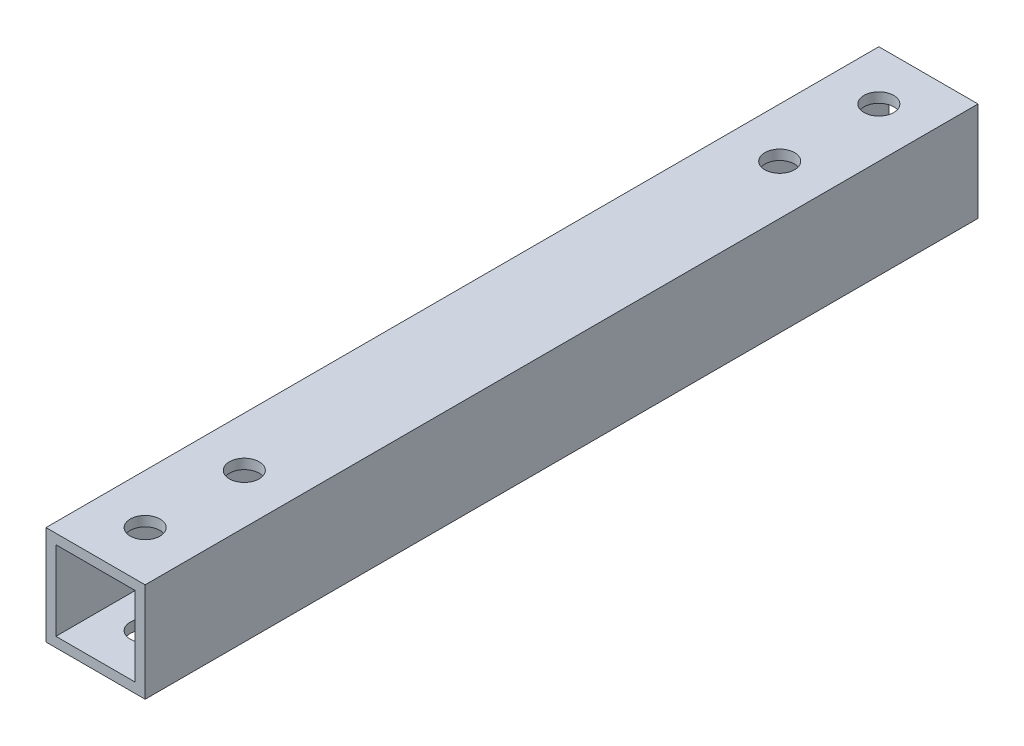
ISO-10303-21;
HEADER;
FILE_DESCRIPTION(('STEP AP214'),'2;1');
FILE_NAME('part.step','',(''),(''),'','','');
FILE_SCHEMA(('AUTOMOTIVE_DESIGN { 1 0 10303 214 1 1 1 1 }'));
ENDSEC;
DATA;
#1=APPLICATION_CONTEXT('core data for automotive mechanical design processes');
#2=APPLICATION_PROTOCOL_DEFINITION('international standard','automotive_design',2000,#1);
#3=PRODUCT_CONTEXT('',#1,'mechanical');
#4=PRODUCT('Part','Part','',(#3));
#5=PRODUCT_RELATED_PRODUCT_CATEGORY('part','',(#4));
#6=PRODUCT_DEFINITION_FORMATION('','',#4);
#7=PRODUCT_DEFINITION_CONTEXT('part definition',#1,'design');
#8=PRODUCT_DEFINITION('design','',#6,#7);
#9=PRODUCT_DEFINITION_SHAPE('','',#8);
#10=(LENGTH_UNIT() NAMED_UNIT(*) SI_UNIT(.MILLI.,.METRE.));
#11=(NAMED_UNIT(*) PLANE_ANGLE_UNIT() SI_UNIT($,.RADIAN.));
#12=(NAMED_UNIT(*) SI_UNIT($,.STERADIAN.) SOLID_ANGLE_UNIT());
#13=UNCERTAINTY_MEASURE_WITH_UNIT(LENGTH_MEASURE(1.E-05),#10,'distance_accuracy_value','');
#14=(GEOMETRIC_REPRESENTATION_CONTEXT(3) GLOBAL_UNCERTAINTY_ASSIGNED_CONTEXT((#13)) GLOBAL_UNIT_ASSIGNED_CONTEXT((#10,
#11,#12)) REPRESENTATION_CONTEXT('',''));
#15=CARTESIAN_POINT('',(0.,0.,0.));
#16=DIRECTION('',(0.,0.,1.));
#17=DIRECTION('',(1.,0.,0.));
#18=AXIS2_PLACEMENT_3D('',#15,#16,#17);
#19=CARTESIAN_POINT('',(0.,0.,84.));
#20=DIRECTION('',(0.,0.,1.));
#21=DIRECTION('',(1.,0.,0.));
#22=AXIS2_PLACEMENT_3D('',#19,#20,#21);
#23=PLANE('',#22);
#24=DIRECTION('',(0.,-1.,0.));
#25=VECTOR('',#24,1.);
#26=CARTESIAN_POINT('',(-77.0766650445814,0.,84.));
#27=LINE('',#26,#25);
#28=CARTESIAN_POINT('',(-77.0766650445814,0.,84.));
#29=VERTEX_POINT('',#28);
#30=CARTESIAN_POINT('',(-77.0766650445814,-10.,84.));
#31=VERTEX_POINT('',#30);
#32=EDGE_CURVE('E168',#29,#31,#27,.T.);
#33=ORIENTED_EDGE('',*,*,#32,.T.);
#34=DIRECTION('',(1.,0.,0.));
#35=VECTOR('',#34,1.);
#36=CARTESIAN_POINT('',(-77.0766650445814,-10.,84.));
#37=LINE('',#36,#35);
#38=CARTESIAN_POINT('',(-67.0766650445814,-10.,84.));
#39=VERTEX_POINT('',#38);
#40=EDGE_CURVE('E171',#31,#39,#37,.T.);
#41=ORIENTED_EDGE('',*,*,#40,.T.);
#42=DIRECTION('',(0.,1.,0.));
#43=VECTOR('',#42,1.);
#44=CARTESIAN_POINT('',(-67.0766650445814,0.,84.));
#45=LINE('',#44,#43);
#46=CARTESIAN_POINT('',(-67.0766650445814,0.,84.));
#47=VERTEX_POINT('',#46);
#48=EDGE_CURVE('E174',#39,#47,#45,.T.);
#49=ORIENTED_EDGE('',*,*,#48,.T.);
#50=DIRECTION('',(-1.,0.,0.));
#51=VECTOR('',#50,1.);
#52=CARTESIAN_POINT('',(-77.0766650445814,0.,84.));
#53=LINE('',#52,#51);
#54=EDGE_CURVE('E176',#47,#29,#53,.T.);
#55=ORIENTED_EDGE('',*,*,#54,.T.);
#56=EDGE_LOOP('',(#33,#41,#49,#55));
#57=FACE_BOUND('',#56,.T.);
#58=DIRECTION('',(1.,0.,0.));
#59=VECTOR('',#58,1.);
#60=CARTESIAN_POINT('',(-77.0766650445814,-9.,84.));
#61=LINE('',#60,#59);
#62=CARTESIAN_POINT('',(-76.0766650445814,-9.,84.));
#63=VERTEX_POINT('',#62);
#64=CARTESIAN_POINT('',(-68.0766650445814,-9.,84.));
#65=VERTEX_POINT('',#64);
#66=EDGE_CURVE('E138',#63,#65,#61,.T.);
#67=ORIENTED_EDGE('',*,*,#66,.F.);
#68=DIRECTION('',(0.,-1.,0.));
#69=VECTOR('',#68,1.);
#70=CARTESIAN_POINT('',(-76.0766650445814,0.,84.));
#71=LINE('',#70,#69);
#72=CARTESIAN_POINT('',(-76.0766650445814,-1.,84.));
#73=VERTEX_POINT('',#72);
#74=EDGE_CURVE('E130',#73,#63,#71,.T.);
#75=ORIENTED_EDGE('',*,*,#74,.F.);
#76=DIRECTION('',(-1.,0.,0.));
#77=VECTOR('',#76,1.);
#78=CARTESIAN_POINT('',(-77.0766650445814,-1.,84.));
#79=LINE('',#78,#77);
#80=CARTESIAN_POINT('',(-68.0766650445814,-1.,84.));
#81=VERTEX_POINT('',#80);
#82=EDGE_CURVE('E152',#81,#73,#79,.T.);
#83=ORIENTED_EDGE('',*,*,#82,.F.);
#84=DIRECTION('',(0.,1.,0.));
#85=VECTOR('',#84,1.);
#86=CARTESIAN_POINT('',(-68.0766650445814,0.,84.));
#87=LINE('',#86,#85);
#88=EDGE_CURVE('E150',#65,#81,#87,.T.);
#89=ORIENTED_EDGE('',*,*,#88,.F.);
#90=EDGE_LOOP('',(#67,#75,#83,#89));
#91=FACE_BOUND('',#90,.T.);
#92=ADVANCED_FACE('F63',(#57,#91),#23,.T.);
#93=CARTESIAN_POINT('',(0.,0.,0.));
#94=DIRECTION('',(0.,0.,1.));
#95=DIRECTION('',(1.,0.,0.));
#96=AXIS2_PLACEMENT_3D('',#93,#94,#95);
#97=PLANE('',#96);
#98=DIRECTION('',(0.,-1.,0.));
#99=VECTOR('',#98,1.);
#100=CARTESIAN_POINT('',(-77.0766650445814,0.,0.));
#101=LINE('',#100,#99);
#102=CARTESIAN_POINT('',(-77.0766650445814,0.,0.));
#103=VERTEX_POINT('',#102);
#104=CARTESIAN_POINT('',(-77.0766650445814,-10.,0.));
#105=VERTEX_POINT('',#104);
#106=EDGE_CURVE('E146',#103,#105,#101,.T.);
#107=ORIENTED_EDGE('',*,*,#106,.F.);
#108=DIRECTION('',(-1.,0.,0.));
#109=VECTOR('',#108,1.);
#110=CARTESIAN_POINT('',(-77.0766650445814,0.,0.));
#111=LINE('',#110,#109);
#112=CARTESIAN_POINT('',(-67.0766650445814,0.,0.));
#113=VERTEX_POINT('',#112);
#114=EDGE_CURVE('E172',#113,#103,#111,.T.);
#115=ORIENTED_EDGE('',*,*,#114,.F.);
#116=DIRECTION('',(0.,1.,0.));
#117=VECTOR('',#116,1.);
#118=CARTESIAN_POINT('',(-67.0766650445814,0.,0.));
#119=LINE('',#118,#117);
#120=CARTESIAN_POINT('',(-67.0766650445814,-10.,0.));
#121=VERTEX_POINT('',#120);
#122=EDGE_CURVE('E183',#121,#113,#119,.T.);
#123=ORIENTED_EDGE('',*,*,#122,.F.);
#124=DIRECTION('',(1.,0.,0.));
#125=VECTOR('',#124,1.);
#126=CARTESIAN_POINT('',(-77.0766650445814,-10.,0.));
#127=LINE('',#126,#125);
#128=EDGE_CURVE('E181',#105,#121,#127,.T.);
#129=ORIENTED_EDGE('',*,*,#128,.F.);
#130=EDGE_LOOP('',(#107,#115,#123,#129));
#131=FACE_BOUND('',#130,.T.);
#132=DIRECTION('',(0.,-1.,0.));
#133=VECTOR('',#132,1.);
#134=CARTESIAN_POINT('',(-76.0766650445814,0.,0.));
#135=LINE('',#134,#133);
#136=CARTESIAN_POINT('',(-76.0766650445814,-1.,0.));
#137=VERTEX_POINT('',#136);
#138=CARTESIAN_POINT('',(-76.0766650445814,-9.,0.));
#139=VERTEX_POINT('',#138);
#140=EDGE_CURVE('E88',#137,#139,#135,.T.);
#141=ORIENTED_EDGE('',*,*,#140,.T.);
#142=DIRECTION('',(1.,0.,0.));
#143=VECTOR('',#142,1.);
#144=CARTESIAN_POINT('',(-77.0766650445814,-9.,0.));
#145=LINE('',#144,#143);
#146=CARTESIAN_POINT('',(-68.0766650445814,-9.,0.));
#147=VERTEX_POINT('',#146);
#148=EDGE_CURVE('E145',#139,#147,#145,.T.);
#149=ORIENTED_EDGE('',*,*,#148,.T.);
#150=DIRECTION('',(0.,1.,0.));
#151=VECTOR('',#150,1.);
#152=CARTESIAN_POINT('',(-68.0766650445814,0.,0.));
#153=LINE('',#152,#151);
#154=CARTESIAN_POINT('',(-68.0766650445814,-1.,0.));
#155=VERTEX_POINT('',#154);
#156=EDGE_CURVE('E160',#147,#155,#153,.T.);
#157=ORIENTED_EDGE('',*,*,#156,.T.);
#158=DIRECTION('',(-1.,0.,0.));
#159=VECTOR('',#158,1.);
#160=CARTESIAN_POINT('',(-77.0766650445814,-1.,0.));
#161=LINE('',#160,#159);
#162=EDGE_CURVE('E139',#155,#137,#161,.T.);
#163=ORIENTED_EDGE('',*,*,#162,.T.);
#164=EDGE_LOOP('',(#141,#149,#157,#163));
#165=FACE_BOUND('',#164,.T.);
#166=ADVANCED_FACE('F235',(#131,#165),#97,.F.);
#167=CARTESIAN_POINT('',(-77.0766650445814,0.,84.));
#168=DIRECTION('',(1.,0.,0.));
#169=DIRECTION('',(0.,0.,-1.));
#170=AXIS2_PLACEMENT_3D('',#167,#168,#169);
#171=PLANE('',#170);
#172=ORIENTED_EDGE('',*,*,#106,.T.);
#173=DIRECTION('',(0.,0.,-1.));
#174=VECTOR('',#173,1.);
#175=CARTESIAN_POINT('',(-77.0766650445814,-10.,84.));
#176=LINE('',#175,#174);
#177=EDGE_CURVE('E12',#31,#105,#176,.T.);
#178=ORIENTED_EDGE('',*,*,#177,.F.);
#179=ORIENTED_EDGE('',*,*,#32,.F.);
#180=DIRECTION('',(0.,0.,-1.));
#181=VECTOR('',#180,1.);
#182=CARTESIAN_POINT('',(-77.0766650445814,0.,84.));
#183=LINE('',#182,#181);
#184=EDGE_CURVE('E178',#29,#103,#183,.T.);
#185=ORIENTED_EDGE('',*,*,#184,.T.);
#186=EDGE_LOOP('',(#172,#178,#179,#185));
#187=FACE_BOUND('',#186,.T.);
#188=ADVANCED_FACE('F65',(#187),#171,.F.);
#189=CARTESIAN_POINT('',(-77.0766650445814,-10.,84.));
#190=DIRECTION('',(0.,1.,0.));
#191=DIRECTION('',(0.,0.,1.));
#192=AXIS2_PLACEMENT_3D('',#189,#190,#191);
#193=PLANE('',#192);
#194=CARTESIAN_POINT('',(-72.0766650445814,-10.,5.));
#195=DIRECTION('',(0.,-1.,0.));
#196=DIRECTION('',(0.,0.,-1.));
#197=AXIS2_PLACEMENT_3D('',#194,#195,#196);
#198=CIRCLE('',#197,1.5);
#199=CARTESIAN_POINT('',(-72.0766650445814,-10.,3.5));
#200=VERTEX_POINT('',#199);
#201=EDGE_CURVE('E271',#200,#200,#198,.T.);
#202=ORIENTED_EDGE('',*,*,#201,.F.);
#203=EDGE_LOOP('',(#202));
#204=FACE_BOUND('',#203,.T.);
#205=CARTESIAN_POINT('',(-72.0766650445814,-10.,79.));
#206=DIRECTION('',(0.,-1.,0.));
#207=DIRECTION('',(0.,0.,-1.));
#208=AXIS2_PLACEMENT_3D('',#205,#206,#207);
#209=CIRCLE('',#208,1.5);
#210=CARTESIAN_POINT('',(-72.0766650445814,-10.,77.5));
#211=VERTEX_POINT('',#210);
#212=EDGE_CURVE('E275',#211,#211,#209,.T.);
#213=ORIENTED_EDGE('',*,*,#212,.F.);
#214=EDGE_LOOP('',(#213));
#215=FACE_BOUND('',#214,.T.);
#216=CARTESIAN_POINT('',(-72.0766650445814,-10.,69.));
#217=DIRECTION('',(0.,-1.,0.));
#218=DIRECTION('',(0.,0.,-1.));
#219=AXIS2_PLACEMENT_3D('',#216,#217,#218);
#220=CIRCLE('',#219,1.5);
#221=CARTESIAN_POINT('',(-72.0766650445814,-10.,67.5));
#222=VERTEX_POINT('',#221);
#223=EDGE_CURVE('E279',#222,#222,#220,.T.);
#224=ORIENTED_EDGE('',*,*,#223,.F.);
#225=EDGE_LOOP('',(#224));
#226=FACE_BOUND('',#225,.T.);
#227=CARTESIAN_POINT('',(-72.0766650445814,-10.,15.));
#228=DIRECTION('',(0.,-1.,0.));
#229=DIRECTION('',(0.,0.,1.));
#230=AXIS2_PLACEMENT_3D('',#227,#228,#229);
#231=CIRCLE('',#230,1.5);
#232=CARTESIAN_POINT('',(-72.0766650445814,-10.,16.5));
#233=VERTEX_POINT('',#232);
#234=EDGE_CURVE('E283',#233,#233,#231,.T.);
#235=ORIENTED_EDGE('',*,*,#234,.F.);
#236=EDGE_LOOP('',(#235));
#237=FACE_BOUND('',#236,.T.);
#238=ORIENTED_EDGE('',*,*,#128,.T.);
#239=DIRECTION('',(0.,0.,-1.));
#240=VECTOR('',#239,1.);
#241=CARTESIAN_POINT('',(-67.0766650445814,-10.,84.));
#242=LINE('',#241,#240);
#243=EDGE_CURVE('E72',#39,#121,#242,.T.);
#244=ORIENTED_EDGE('',*,*,#243,.F.);
#245=ORIENTED_EDGE('',*,*,#40,.F.);
#246=ORIENTED_EDGE('',*,*,#177,.T.);
#247=EDGE_LOOP('',(#238,#244,#245,#246));
#248=FACE_BOUND('',#247,.T.);
#249=ADVANCED_FACE('F260',(#204,#215,#226,#237,#248),#193,.F.);
#250=CARTESIAN_POINT('',(-67.0766650445814,0.,84.));
#251=DIRECTION('',(-1.,0.,0.));
#252=DIRECTION('',(0.,0.,1.));
#253=AXIS2_PLACEMENT_3D('',#250,#251,#252);
#254=PLANE('',#253);
#255=ORIENTED_EDGE('',*,*,#122,.T.);
#256=DIRECTION('',(0.,0.,-1.));
#257=VECTOR('',#256,1.);
#258=CARTESIAN_POINT('',(-67.0766650445814,0.,84.));
#259=LINE('',#258,#257);
#260=EDGE_CURVE('E188',#47,#113,#259,.T.);
#261=ORIENTED_EDGE('',*,*,#260,.F.);
#262=ORIENTED_EDGE('',*,*,#48,.F.);
#263=ORIENTED_EDGE('',*,*,#243,.T.);
#264=EDGE_LOOP('',(#255,#261,#262,#263));
#265=FACE_BOUND('',#264,.T.);
#266=ADVANCED_FACE('F257',(#265),#254,.F.);
#267=CARTESIAN_POINT('',(-77.0766650445814,0.,84.));
#268=DIRECTION('',(0.,-1.,0.));
#269=DIRECTION('',(0.,0.,-1.));
#270=AXIS2_PLACEMENT_3D('',#267,#268,#269);
#271=PLANE('',#270);
#272=CARTESIAN_POINT('',(-72.0766650445814,0.,5.));
#273=DIRECTION('',(0.,-1.,0.));
#274=DIRECTION('',(0.,0.,-1.));
#275=AXIS2_PLACEMENT_3D('',#272,#273,#274);
#276=CIRCLE('',#275,1.5);
#277=CARTESIAN_POINT('',(-72.0766650445814,0.,3.5));
#278=VERTEX_POINT('',#277);
#279=EDGE_CURVE('E197',#278,#278,#276,.T.);
#280=ORIENTED_EDGE('',*,*,#279,.T.);
#281=EDGE_LOOP('',(#280));
#282=FACE_BOUND('',#281,.T.);
#283=CARTESIAN_POINT('',(-72.0766650445814,0.,79.));
#284=DIRECTION('',(0.,-1.,0.));
#285=DIRECTION('',(0.,0.,-1.));
#286=AXIS2_PLACEMENT_3D('',#283,#284,#285);
#287=CIRCLE('',#286,1.5);
#288=CARTESIAN_POINT('',(-72.0766650445814,0.,77.5));
#289=VERTEX_POINT('',#288);
#290=EDGE_CURVE('E304',#289,#289,#287,.T.);
#291=ORIENTED_EDGE('',*,*,#290,.T.);
#292=EDGE_LOOP('',(#291));
#293=FACE_BOUND('',#292,.T.);
#294=CARTESIAN_POINT('',(-72.0766650445814,0.,69.));
#295=DIRECTION('',(0.,-1.,0.));
#296=DIRECTION('',(0.,0.,-1.));
#297=AXIS2_PLACEMENT_3D('',#294,#295,#296);
#298=CIRCLE('',#297,1.5);
#299=CARTESIAN_POINT('',(-72.0766650445814,0.,67.5));
#300=VERTEX_POINT('',#299);
#301=EDGE_CURVE('E296',#300,#300,#298,.T.);
#302=ORIENTED_EDGE('',*,*,#301,.T.);
#303=EDGE_LOOP('',(#302));
#304=FACE_BOUND('',#303,.T.);
#305=CARTESIAN_POINT('',(-72.0766650445814,0.,15.));
#306=DIRECTION('',(0.,-1.,0.));
#307=DIRECTION('',(0.,0.,1.));
#308=AXIS2_PLACEMENT_3D('',#305,#306,#307);
#309=CIRCLE('',#308,1.5);
#310=CARTESIAN_POINT('',(-72.0766650445814,0.,16.5));
#311=VERTEX_POINT('',#310);
#312=EDGE_CURVE('E297',#311,#311,#309,.T.);
#313=ORIENTED_EDGE('',*,*,#312,.T.);
#314=EDGE_LOOP('',(#313));
#315=FACE_BOUND('',#314,.T.);
#316=ORIENTED_EDGE('',*,*,#114,.T.);
#317=ORIENTED_EDGE('',*,*,#184,.F.);
#318=ORIENTED_EDGE('',*,*,#54,.F.);
#319=ORIENTED_EDGE('',*,*,#260,.T.);
#320=EDGE_LOOP('',(#316,#317,#318,#319));
#321=FACE_BOUND('',#320,.T.);
#322=ADVANCED_FACE('F254',(#282,#293,#304,#315,#321),#271,.F.);
#323=CARTESIAN_POINT('',(-76.0766650445814,0.,84.));
#324=DIRECTION('',(1.,0.,0.));
#325=DIRECTION('',(0.,0.,-1.));
#326=AXIS2_PLACEMENT_3D('',#323,#324,#325);
#327=PLANE('',#326);
#328=ORIENTED_EDGE('',*,*,#140,.F.);
#329=DIRECTION('',(0.,0.,-1.));
#330=VECTOR('',#329,1.);
#331=CARTESIAN_POINT('',(-76.0766650445814,-1.,84.));
#332=LINE('',#331,#330);
#333=EDGE_CURVE('E134',#73,#137,#332,.T.);
#334=ORIENTED_EDGE('',*,*,#333,.F.);
#335=ORIENTED_EDGE('',*,*,#74,.T.);
#336=DIRECTION('',(0.,0.,-1.));
#337=VECTOR('',#336,1.);
#338=CARTESIAN_POINT('',(-76.0766650445814,-9.,84.));
#339=LINE('',#338,#337);
#340=EDGE_CURVE('E133',#63,#139,#339,.T.);
#341=ORIENTED_EDGE('',*,*,#340,.T.);
#342=EDGE_LOOP('',(#328,#334,#335,#341));
#343=FACE_BOUND('',#342,.T.);
#344=ADVANCED_FACE('F132',(#343),#327,.T.);
#345=CARTESIAN_POINT('',(-77.0766650445814,-9.,84.));
#346=DIRECTION('',(0.,1.,0.));
#347=DIRECTION('',(0.,0.,1.));
#348=AXIS2_PLACEMENT_3D('',#345,#346,#347);
#349=PLANE('',#348);
#350=CARTESIAN_POINT('',(-72.0766650445814,-9.,5.));
#351=DIRECTION('',(0.,1.,0.));
#352=DIRECTION('',(0.,0.,1.));
#353=AXIS2_PLACEMENT_3D('',#350,#351,#352);
#354=CIRCLE('',#353,1.5);
#355=CARTESIAN_POINT('',(-72.0766650445814,-9.,6.5));
#356=VERTEX_POINT('',#355);
#357=EDGE_CURVE('E158',#356,#356,#354,.T.);
#358=ORIENTED_EDGE('',*,*,#357,.F.);
#359=EDGE_LOOP('',(#358));
#360=FACE_BOUND('',#359,.T.);
#361=CARTESIAN_POINT('',(-72.0766650445814,-9.,79.));
#362=DIRECTION('',(0.,1.,0.));
#363=DIRECTION('',(0.,0.,1.));
#364=AXIS2_PLACEMENT_3D('',#361,#362,#363);
#365=CIRCLE('',#364,1.5);
#366=CARTESIAN_POINT('',(-72.0766650445814,-9.,80.5));
#367=VERTEX_POINT('',#366);
#368=EDGE_CURVE('E203',#367,#367,#365,.T.);
#369=ORIENTED_EDGE('',*,*,#368,.F.);
#370=EDGE_LOOP('',(#369));
#371=FACE_BOUND('',#370,.T.);
#372=CARTESIAN_POINT('',(-72.0766650445814,-9.,69.));
#373=DIRECTION('',(0.,1.,0.));
#374=DIRECTION('',(0.,0.,1.));
#375=AXIS2_PLACEMENT_3D('',#372,#373,#374);
#376=CIRCLE('',#375,1.5);
#377=CARTESIAN_POINT('',(-72.0766650445814,-9.,70.5));
#378=VERTEX_POINT('',#377);
#379=EDGE_CURVE('E200',#378,#378,#376,.T.);
#380=ORIENTED_EDGE('',*,*,#379,.F.);
#381=EDGE_LOOP('',(#380));
#382=FACE_BOUND('',#381,.T.);
#383=CARTESIAN_POINT('',(-72.0766650445814,-9.,15.));
#384=DIRECTION('',(0.,1.,0.));
#385=DIRECTION('',(0.,0.,1.));
#386=AXIS2_PLACEMENT_3D('',#383,#384,#385);
#387=CIRCLE('',#386,1.5);
#388=CARTESIAN_POINT('',(-72.0766650445814,-9.,16.5));
#389=VERTEX_POINT('',#388);
#390=EDGE_CURVE('E196',#389,#389,#387,.T.);
#391=ORIENTED_EDGE('',*,*,#390,.F.);
#392=EDGE_LOOP('',(#391));
#393=FACE_BOUND('',#392,.T.);
#394=ORIENTED_EDGE('',*,*,#148,.F.);
#395=ORIENTED_EDGE('',*,*,#340,.F.);
#396=ORIENTED_EDGE('',*,*,#66,.T.);
#397=DIRECTION('',(0.,0.,-1.));
#398=VECTOR('',#397,1.);
#399=CARTESIAN_POINT('',(-68.0766650445814,-9.,84.));
#400=LINE('',#399,#398);
#401=EDGE_CURVE('E147',#65,#147,#400,.T.);
#402=ORIENTED_EDGE('',*,*,#401,.T.);
#403=EDGE_LOOP('',(#394,#395,#396,#402));
#404=FACE_BOUND('',#403,.T.);
#405=ADVANCED_FACE('F142',(#360,#371,#382,#393,#404),#349,.T.);
#406=CARTESIAN_POINT('',(-68.0766650445814,0.,84.));
#407=DIRECTION('',(-1.,0.,0.));
#408=DIRECTION('',(0.,0.,1.));
#409=AXIS2_PLACEMENT_3D('',#406,#407,#408);
#410=PLANE('',#409);
#411=ORIENTED_EDGE('',*,*,#156,.F.);
#412=ORIENTED_EDGE('',*,*,#401,.F.);
#413=ORIENTED_EDGE('',*,*,#88,.T.);
#414=DIRECTION('',(0.,0.,-1.));
#415=VECTOR('',#414,1.);
#416=CARTESIAN_POINT('',(-68.0766650445814,-1.,84.));
#417=LINE('',#416,#415);
#418=EDGE_CURVE('E80',#81,#155,#417,.T.);
#419=ORIENTED_EDGE('',*,*,#418,.T.);
#420=EDGE_LOOP('',(#411,#412,#413,#419));
#421=FACE_BOUND('',#420,.T.);
#422=ADVANCED_FACE('F227',(#421),#410,.T.);
#423=CARTESIAN_POINT('',(-77.0766650445814,-1.,84.));
#424=DIRECTION('',(0.,-1.,0.));
#425=DIRECTION('',(0.,0.,-1.));
#426=AXIS2_PLACEMENT_3D('',#423,#424,#425);
#427=PLANE('',#426);
#428=CARTESIAN_POINT('',(-72.0766650445814,-1.,5.));
#429=DIRECTION('',(0.,-1.,0.));
#430=DIRECTION('',(0.,0.,-1.));
#431=AXIS2_PLACEMENT_3D('',#428,#429,#430);
#432=CIRCLE('',#431,1.5);
#433=CARTESIAN_POINT('',(-72.0766650445814,-1.,3.5));
#434=VERTEX_POINT('',#433);
#435=EDGE_CURVE('E67',#434,#434,#432,.T.);
#436=ORIENTED_EDGE('',*,*,#435,.F.);
#437=EDGE_LOOP('',(#436));
#438=FACE_BOUND('',#437,.T.);
#439=CARTESIAN_POINT('',(-72.0766650445814,-1.,79.));
#440=DIRECTION('',(0.,-1.,0.));
#441=DIRECTION('',(0.,0.,-1.));
#442=AXIS2_PLACEMENT_3D('',#439,#440,#441);
#443=CIRCLE('',#442,1.5);
#444=CARTESIAN_POINT('',(-72.0766650445814,-1.,77.5));
#445=VERTEX_POINT('',#444);
#446=EDGE_CURVE('E201',#445,#445,#443,.T.);
#447=ORIENTED_EDGE('',*,*,#446,.F.);
#448=EDGE_LOOP('',(#447));
#449=FACE_BOUND('',#448,.T.);
#450=CARTESIAN_POINT('',(-72.0766650445814,-1.,69.));
#451=DIRECTION('',(0.,-1.,0.));
#452=DIRECTION('',(0.,0.,-1.));
#453=AXIS2_PLACEMENT_3D('',#450,#451,#452);
#454=CIRCLE('',#453,1.5);
#455=CARTESIAN_POINT('',(-72.0766650445814,-1.,67.5));
#456=VERTEX_POINT('',#455);
#457=EDGE_CURVE('E198',#456,#456,#454,.T.);
#458=ORIENTED_EDGE('',*,*,#457,.F.);
#459=EDGE_LOOP('',(#458));
#460=FACE_BOUND('',#459,.T.);
#461=CARTESIAN_POINT('',(-72.0766650445814,-1.,15.));
#462=DIRECTION('',(0.,-1.,0.));
#463=DIRECTION('',(0.,0.,-1.));
#464=AXIS2_PLACEMENT_3D('',#461,#462,#463);
#465=CIRCLE('',#464,1.5);
#466=CARTESIAN_POINT('',(-72.0766650445814,-1.,13.5));
#467=VERTEX_POINT('',#466);
#468=EDGE_CURVE('E193',#467,#467,#465,.T.);
#469=ORIENTED_EDGE('',*,*,#468,.F.);
#470=EDGE_LOOP('',(#469));
#471=FACE_BOUND('',#470,.T.);
#472=ORIENTED_EDGE('',*,*,#162,.F.);
#473=ORIENTED_EDGE('',*,*,#418,.F.);
#474=ORIENTED_EDGE('',*,*,#82,.T.);
#475=ORIENTED_EDGE('',*,*,#333,.T.);
#476=EDGE_LOOP('',(#472,#473,#474,#475));
#477=FACE_BOUND('',#476,.T.);
#478=ADVANCED_FACE('F223',(#438,#449,#460,#471,#477),#427,.T.);
#479=CARTESIAN_POINT('',(-72.0766650445814,0.,15.));
#480=DIRECTION('',(0.,-1.,0.));
#481=DIRECTION('',(0.,0.,-1.));
#482=AXIS2_PLACEMENT_3D('',#479,#480,#481);
#483=CYLINDRICAL_SURFACE('',#482,1.5);
#484=ORIENTED_EDGE('',*,*,#468,.T.);
#485=EDGE_LOOP('',(#484));
#486=FACE_BOUND('',#485,.T.);
#487=ORIENTED_EDGE('',*,*,#312,.F.);
#488=EDGE_LOOP('',(#487));
#489=FACE_BOUND('',#488,.T.);
#490=ADVANCED_FACE('F226',(#486,#489),#483,.F.);
#491=CARTESIAN_POINT('',(-72.0766650445814,0.,69.));
#492=DIRECTION('',(0.,-1.,0.));
#493=DIRECTION('',(0.,0.,-1.));
#494=AXIS2_PLACEMENT_3D('',#491,#492,#493);
#495=CYLINDRICAL_SURFACE('',#494,1.5);
#496=ORIENTED_EDGE('',*,*,#457,.T.);
#497=EDGE_LOOP('',(#496));
#498=FACE_BOUND('',#497,.T.);
#499=ORIENTED_EDGE('',*,*,#301,.F.);
#500=EDGE_LOOP('',(#499));
#501=FACE_BOUND('',#500,.T.);
#502=ADVANCED_FACE('F324',(#498,#501),#495,.F.);
#503=CARTESIAN_POINT('',(-72.0766650445814,0.,79.));
#504=DIRECTION('',(0.,-1.,0.));
#505=DIRECTION('',(0.,0.,-1.));
#506=AXIS2_PLACEMENT_3D('',#503,#504,#505);
#507=CYLINDRICAL_SURFACE('',#506,1.5);
#508=ORIENTED_EDGE('',*,*,#446,.T.);
#509=EDGE_LOOP('',(#508));
#510=FACE_BOUND('',#509,.T.);
#511=ORIENTED_EDGE('',*,*,#290,.F.);
#512=EDGE_LOOP('',(#511));
#513=FACE_BOUND('',#512,.T.);
#514=ADVANCED_FACE('F314',(#510,#513),#507,.F.);
#515=CARTESIAN_POINT('',(-72.0766650445814,0.,5.));
#516=DIRECTION('',(0.,-1.,0.));
#517=DIRECTION('',(0.,0.,-1.));
#518=AXIS2_PLACEMENT_3D('',#515,#516,#517);
#519=CYLINDRICAL_SURFACE('',#518,1.5);
#520=ORIENTED_EDGE('',*,*,#435,.T.);
#521=EDGE_LOOP('',(#520));
#522=FACE_BOUND('',#521,.T.);
#523=ORIENTED_EDGE('',*,*,#279,.F.);
#524=EDGE_LOOP('',(#523));
#525=FACE_BOUND('',#524,.T.);
#526=ADVANCED_FACE('F220',(#522,#525),#519,.F.);
#527=ORIENTED_EDGE('',*,*,#390,.T.);
#528=EDGE_LOOP('',(#527));
#529=FACE_BOUND('',#528,.T.);
#530=ORIENTED_EDGE('',*,*,#234,.T.);
#531=EDGE_LOOP('',(#530));
#532=FACE_BOUND('',#531,.T.);
#533=ADVANCED_FACE('F313',(#529,#532),#483,.F.);
#534=ORIENTED_EDGE('',*,*,#379,.T.);
#535=EDGE_LOOP('',(#534));
#536=FACE_BOUND('',#535,.T.);
#537=ORIENTED_EDGE('',*,*,#223,.T.);
#538=EDGE_LOOP('',(#537));
#539=FACE_BOUND('',#538,.T.);
#540=ADVANCED_FACE('F321',(#536,#539),#495,.F.);
#541=ORIENTED_EDGE('',*,*,#368,.T.);
#542=EDGE_LOOP('',(#541));
#543=FACE_BOUND('',#542,.T.);
#544=ORIENTED_EDGE('',*,*,#212,.T.);
#545=EDGE_LOOP('',(#544));
#546=FACE_BOUND('',#545,.T.);
#547=ADVANCED_FACE('F326',(#543,#546),#507,.F.);
#548=ORIENTED_EDGE('',*,*,#357,.T.);
#549=EDGE_LOOP('',(#548));
#550=FACE_BOUND('',#549,.T.);
#551=ORIENTED_EDGE('',*,*,#201,.T.);
#552=EDGE_LOOP('',(#551));
#553=FACE_BOUND('',#552,.T.);
#554=ADVANCED_FACE('F316',(#550,#553),#519,.F.);
#555=CLOSED_SHELL('',(#92,#166,#188,#249,#266,#322,#344,#405,#422,#478,#490,#502,#514,#526,#533,
#540,#547,#554));
#556=MANIFOLD_SOLID_BREP('B2',#555);
#557=ADVANCED_BREP_SHAPE_REPRESENTATION('',(#18,#556),#14);
#558=SHAPE_DEFINITION_REPRESENTATION(#9,#557);
ENDSEC;
END-ISO-10303-21;
